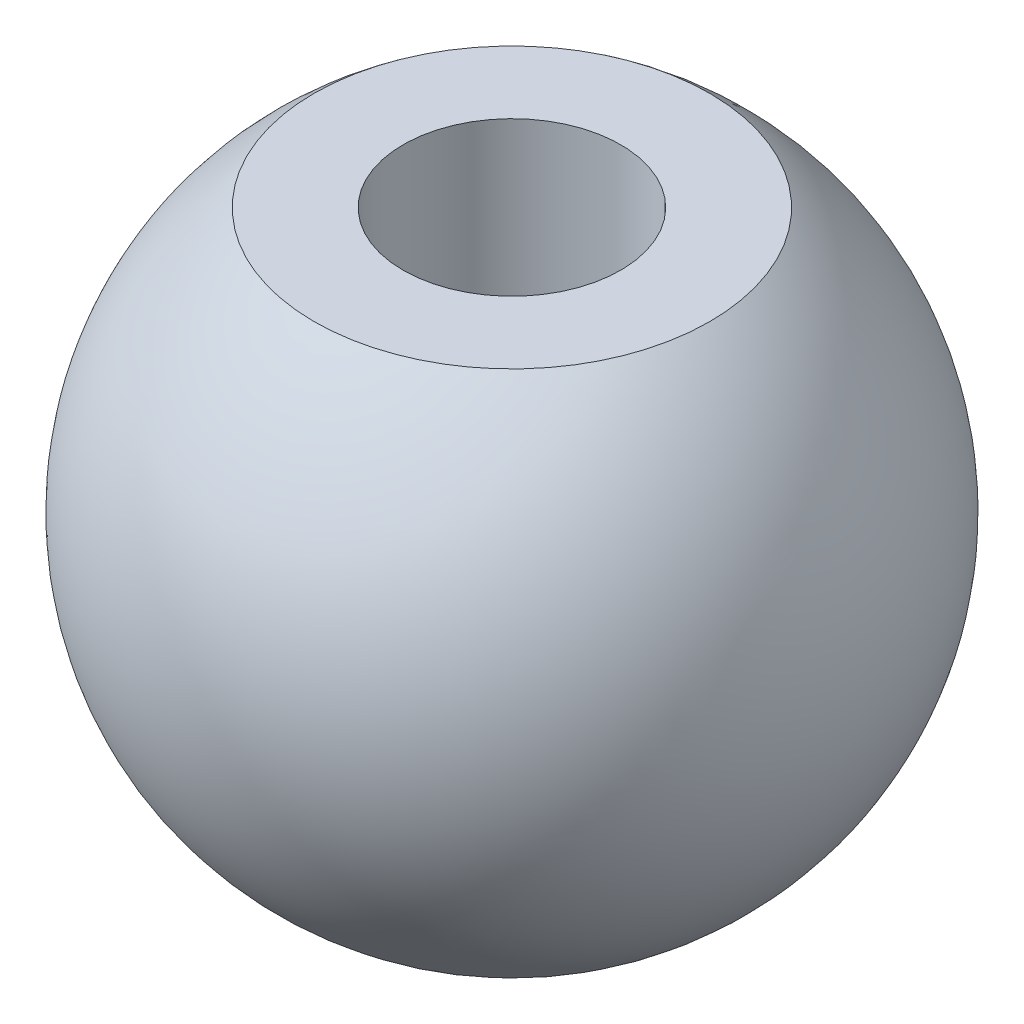
ISO-10303-21;
HEADER;
FILE_DESCRIPTION(('STEP AP214'),'2;1');
FILE_NAME('part.step','',(''),(''),'','','');
FILE_SCHEMA(('AUTOMOTIVE_DESIGN { 1 0 10303 214 1 1 1 1 }'));
ENDSEC;
DATA;
#1=APPLICATION_CONTEXT('core data for automotive mechanical design processes');
#2=APPLICATION_PROTOCOL_DEFINITION('international standard','automotive_design',2000,#1);
#3=PRODUCT_CONTEXT('',#1,'mechanical');
#4=PRODUCT('Part','Part','',(#3));
#5=PRODUCT_RELATED_PRODUCT_CATEGORY('part','',(#4));
#6=PRODUCT_DEFINITION_FORMATION('','',#4);
#7=PRODUCT_DEFINITION_CONTEXT('part definition',#1,'design');
#8=PRODUCT_DEFINITION('design','',#6,#7);
#9=PRODUCT_DEFINITION_SHAPE('','',#8);
#10=(LENGTH_UNIT() NAMED_UNIT(*) SI_UNIT(.MILLI.,.METRE.));
#11=(NAMED_UNIT(*) PLANE_ANGLE_UNIT() SI_UNIT($,.RADIAN.));
#12=(NAMED_UNIT(*) SI_UNIT($,.STERADIAN.) SOLID_ANGLE_UNIT());
#13=UNCERTAINTY_MEASURE_WITH_UNIT(LENGTH_MEASURE(1.E-05),#10,'distance_accuracy_value','');
#14=(GEOMETRIC_REPRESENTATION_CONTEXT(3) GLOBAL_UNCERTAINTY_ASSIGNED_CONTEXT((#13)) GLOBAL_UNIT_ASSIGNED_CONTEXT((#10,
#11,#12)) REPRESENTATION_CONTEXT('',''));
#15=CARTESIAN_POINT('',(0.,0.,0.));
#16=DIRECTION('',(0.,0.,1.));
#17=DIRECTION('',(1.,0.,0.));
#18=AXIS2_PLACEMENT_3D('',#15,#16,#17);
#19=CARTESIAN_POINT('',(0.,3.00000000009959,0.));
#20=DIRECTION('',(0.,1.,0.));
#21=DIRECTION('',(0.,0.,1.));
#22=AXIS2_PLACEMENT_3D('',#19,#20,#21);
#23=CONICAL_SURFACE('',#22,1.65000000009741,1.02974425868617);
#24=CARTESIAN_POINT('',(0.,2.00857997870685,-5.6843418860808E-11));
#25=VERTEX_POINT('',#24);
#26=VERTEX_LOOP('',#25);
#27=FACE_BOUND('',#26,.T.);
#28=CARTESIAN_POINT('',(0.,3.,0.));
#29=DIRECTION('',(0.,1.,0.));
#30=DIRECTION('',(0.,0.,1.));
#31=AXIS2_PLACEMENT_3D('',#28,#29,#30);
#32=CIRCLE('',#31,1.64999999999999);
#33=CARTESIAN_POINT('',(0.,3.,1.64999999999999));
#34=VERTEX_POINT('',#33);
#35=EDGE_CURVE('E38',#34,#34,#32,.T.);
#36=ORIENTED_EDGE('',*,*,#35,.T.);
#37=EDGE_LOOP('',(#36));
#38=FACE_BOUND('',#37,.T.);
#39=ADVANCED_FACE('F17',(#27,#38),#23,.F.);
#40=CARTESIAN_POINT('',(0.,9.,0.));
#41=DIRECTION('',(0.,1.,0.));
#42=DIRECTION('',(0.,0.,1.));
#43=AXIS2_PLACEMENT_3D('',#40,#41,#42);
#44=CYLINDRICAL_SURFACE('',#43,1.64999999999999);
#45=CARTESIAN_POINT('',(0.,9.00000000000001,0.));
#46=DIRECTION('',(0.,1.,0.));
#47=DIRECTION('',(0.,0.,1.));
#48=AXIS2_PLACEMENT_3D('',#45,#46,#47);
#49=CIRCLE('',#48,1.64999999999999);
#50=CARTESIAN_POINT('',(0.,9.00000000000001,1.64999999999999));
#51=VERTEX_POINT('',#50);
#52=EDGE_CURVE('E20',#51,#51,#49,.F.);
#53=ORIENTED_EDGE('',*,*,#52,.F.);
#54=EDGE_LOOP('',(#53));
#55=FACE_BOUND('',#54,.T.);
#56=ORIENTED_EDGE('',*,*,#35,.F.);
#57=EDGE_LOOP('',(#56));
#58=FACE_BOUND('',#57,.T.);
#59=ADVANCED_FACE('F35',(#55,#58),#44,.F.);
#60=CARTESIAN_POINT('',(0.,9.,0.));
#61=DIRECTION('',(0.,1.,0.));
#62=DIRECTION('',(0.,0.,1.));
#63=AXIS2_PLACEMENT_3D('',#60,#61,#62);
#64=PLANE('',#63);
#65=CARTESIAN_POINT('',(3.,9.,0.));
#66=CARTESIAN_POINT('',(2.99999949523358,9.,0.0842305919952533));
#67=CARTESIAN_POINT('',(2.99644943211259,9.,0.168476663637078));
#68=CARTESIAN_POINT('',(2.98227226004286,9.,0.336386615026694));
#69=CARTESIAN_POINT('',(2.9716430617285,9.,0.420050315522544));
#70=CARTESIAN_POINT('',(2.94335544041171,9.,0.586325719817798));
#71=CARTESIAN_POINT('',(2.92568585931676,9.,0.66893553783117));
#72=CARTESIAN_POINT('',(2.8834392718684,9.,0.832418927497677));
#73=CARTESIAN_POINT('',(2.85885666009466,9.,0.91329103260944));
#74=CARTESIAN_POINT('',(2.77507914675548,9.,1.1520882102574));
#75=CARTESIAN_POINT('',(2.70578575365084,9.,1.30659602058505));
#76=CARTESIAN_POINT('',(2.54220609669482,9.,1.60176804513616));
#77=CARTESIAN_POINT('',(2.44791888275831,9.,1.74243173282696));
#78=CARTESIAN_POINT('',(2.28988925157133,9.,1.93998804289462));
#79=CARTESIAN_POINT('',(2.23440451674684,9.,2.00363749091774));
#80=CARTESIAN_POINT('',(2.11831409197694,9.,2.12599212143855));
#81=CARTESIAN_POINT('',(2.05771339098142,9.,2.18470201178521));
#82=CARTESIAN_POINT('',(1.93175254704283,9.,2.29683361010447));
#83=CARTESIAN_POINT('',(1.86639026054782,9.,2.35025291052745));
#84=CARTESIAN_POINT('',(1.73140383285055,9.,2.45140072822542));
#85=CARTESIAN_POINT('',(1.66177870806081,9.,2.49912792458504));
#86=CARTESIAN_POINT('',(1.44726826384113,9.,2.6332068246707));
#87=CARTESIAN_POINT('',(1.29661475821824,9.00000000000001,2.71057412201499));
#88=CARTESIAN_POINT('',(0.984538397939546,9.,2.8388709202637));
#89=CARTESIAN_POINT('',(0.823115658324975,8.99999999999999,2.88980070353314));
#90=CARTESIAN_POINT('',(0.493990143388738,9.00000000000001,2.96385049097127));
#91=CARTESIAN_POINT('',(0.326287334533769,9.00000000000003,2.98697034662314));
#92=CARTESIAN_POINT('',(-0.0106192602137408,8.99999999999998,3.00472003813933));
#93=CARTESIAN_POINT('',(-0.179823046106281,8.99999999999991,2.99934987400365));
#94=CARTESIAN_POINT('',(-0.514907479574972,8.99999999999992,2.96029352946608));
#95=CARTESIAN_POINT('',(-0.680788144893092,9.00000000000001,2.92660750028241));
#96=CARTESIAN_POINT('',(-1.00461791748894,9.,2.83181297793956));
#97=CARTESIAN_POINT('',(-1.16256694003236,8.9999999999999,2.77070419189034));
#98=CARTESIAN_POINT('',(-1.3899784781565,8.99999999999994,2.6599076465673));
#99=CARTESIAN_POINT('',(-1.46423319363285,8.99999999999999,2.61976066033093));
#100=CARTESIAN_POINT('',(-1.60910065464233,9.00000000000002,2.53335675169132));
#101=CARTESIAN_POINT('',(-1.67971423952011,9.00000000000001,2.48710124624338));
#102=CARTESIAN_POINT('',(-1.81676022389609,9.,2.38882598122836));
#103=CARTESIAN_POINT('',(-1.88319450210173,9.,2.33680884112087));
#104=CARTESIAN_POINT('',(-2.01149891422989,9.00000000000001,2.22732998397673));
#105=CARTESIAN_POINT('',(-2.07336458150737,9.,2.16986306092959));
#106=CARTESIAN_POINT('',(-2.25127799272122,9.,1.99000567828742));
#107=CARTESIAN_POINT('',(-2.35982375472715,9.,1.86002810600191));
#108=CARTESIAN_POINT('',(-2.55351363027214,9.,1.5836785802943));
#109=CARTESIAN_POINT('',(-2.63865863331027,9.,1.43730725032208));
#110=CARTESIAN_POINT('',(-2.74706444471415,9.,1.20863511855305));
#111=CARTESIAN_POINT('',(-2.78000876476443,9.,1.13079378015724));
#112=CARTESIAN_POINT('',(-2.83919981739167,9.,0.972654562577402));
#113=CARTESIAN_POINT('',(-2.86545197025815,9.,0.892358730816668));
#114=CARTESIAN_POINT('',(-2.91105470872044,9.,0.729976189150229));
#115=CARTESIAN_POINT('',(-2.93041619248592,9.,0.647892527049513));
#116=CARTESIAN_POINT('',(-2.96215834908893,9.,0.482401803811781));
#117=CARTESIAN_POINT('',(-2.97454108089031,9.00000000000001,0.398995140478582));
#118=CARTESIAN_POINT('',(-2.9889238078401,9.00000000000001,0.262882669784132));
#119=CARTESIAN_POINT('',(-2.99307606547818,9.,0.210394788116347));
#120=CARTESIAN_POINT('',(-2.99861431928428,9.,0.10527328620364));
#121=CARTESIAN_POINT('',(-3.00000031545231,9.,0.0526396659587191));
#122=CARTESIAN_POINT('',(-2.99999949523358,9.,-0.0842305919952533));
#123=CARTESIAN_POINT('',(-2.99644943211259,9.,-0.168476663637078));
#124=CARTESIAN_POINT('',(-2.98227226004286,9.,-0.336386615026693));
#125=CARTESIAN_POINT('',(-2.9716430617285,9.,-0.420050315522543));
#126=CARTESIAN_POINT('',(-2.94335544041171,9.,-0.586325719817797));
#127=CARTESIAN_POINT('',(-2.92568585931676,9.,-0.66893553783117));
#128=CARTESIAN_POINT('',(-2.8834392718684,9.,-0.832418927497676));
#129=CARTESIAN_POINT('',(-2.85885666009466,9.00000000000001,-0.913291032609438));
#130=CARTESIAN_POINT('',(-2.77507914675547,9.00000000000001,-1.1520882102574));
#131=CARTESIAN_POINT('',(-2.70578575365084,9.00000000000001,-1.30659602058505));
#132=CARTESIAN_POINT('',(-2.54220609669482,9.,-1.60176804513616));
#133=CARTESIAN_POINT('',(-2.44791888275831,9.,-1.74243173282696));
#134=CARTESIAN_POINT('',(-2.28988925157133,9.,-1.93998804289462));
#135=CARTESIAN_POINT('',(-2.23440451674683,9.,-2.00363749091774));
#136=CARTESIAN_POINT('',(-2.11831409197693,9.,-2.12599212143855));
#137=CARTESIAN_POINT('',(-2.05771339098142,9.,-2.18470201178521));
#138=CARTESIAN_POINT('',(-1.93175254704283,9.,-2.29683361010447));
#139=CARTESIAN_POINT('',(-1.86639026054782,9.,-2.35025291052745));
#140=CARTESIAN_POINT('',(-1.73140383285055,9.,-2.45140072822542));
#141=CARTESIAN_POINT('',(-1.66177870806081,9.,-2.49912792458504));
#142=CARTESIAN_POINT('',(-1.44726826384113,9.,-2.6332068246707));
#143=CARTESIAN_POINT('',(-1.29661475821824,9.00000000000001,-2.71057412201499));
#144=CARTESIAN_POINT('',(-0.984538397939544,9.,-2.8388709202637));
#145=CARTESIAN_POINT('',(-0.823115658324973,9.,-2.88980070353314));
#146=CARTESIAN_POINT('',(-0.493990143388736,9.00000000000001,-2.96385049097127));
#147=CARTESIAN_POINT('',(-0.326287334533767,9.00000000000003,-2.98697034662314));
#148=CARTESIAN_POINT('',(0.010619260213742,8.99999999999998,-3.00472003813933));
#149=CARTESIAN_POINT('',(0.179823046106282,8.99999999999991,-2.99934987400365));
#150=CARTESIAN_POINT('',(0.514907479574974,8.99999999999992,-2.96029352946608));
#151=CARTESIAN_POINT('',(0.680788144893095,9.00000000000001,-2.92660750028241));
#152=CARTESIAN_POINT('',(1.00461791748895,9.,-2.83181297793956));
#153=CARTESIAN_POINT('',(1.16256694003236,8.9999999999999,-2.77070419189034));
#154=CARTESIAN_POINT('',(1.3899784781565,8.99999999999994,-2.6599076465673));
#155=CARTESIAN_POINT('',(1.46423319363285,8.99999999999999,-2.61976066033093));
#156=CARTESIAN_POINT('',(1.60910065464233,9.00000000000002,-2.53335675169133));
#157=CARTESIAN_POINT('',(1.67971423952011,9.00000000000001,-2.48710124624338));
#158=CARTESIAN_POINT('',(1.8167602238961,9.,-2.38882598122836));
#159=CARTESIAN_POINT('',(1.88319450210173,9.,-2.33680884112087));
#160=CARTESIAN_POINT('',(2.01149891422989,9.00000000000001,-2.22732998397673));
#161=CARTESIAN_POINT('',(2.07336458150737,9.,-2.16986306092959));
#162=CARTESIAN_POINT('',(2.25127799272122,9.,-1.99000567828741));
#163=CARTESIAN_POINT('',(2.35982375472715,9.,-1.86002810600191));
#164=CARTESIAN_POINT('',(2.55351363027214,9.,-1.5836785802943));
#165=CARTESIAN_POINT('',(2.63865863331027,9.,-1.43730725032208));
#166=CARTESIAN_POINT('',(2.74706444471416,9.,-1.20863511855305));
#167=CARTESIAN_POINT('',(2.78000876476443,9.,-1.13079378015723));
#168=CARTESIAN_POINT('',(2.83919981739167,9.,-0.972654562577401));
#169=CARTESIAN_POINT('',(2.86545197025815,9.,-0.892358730816667));
#170=CARTESIAN_POINT('',(2.91105470872044,9.,-0.729976189150228));
#171=CARTESIAN_POINT('',(2.93041619248592,9.,-0.647892527049513));
#172=CARTESIAN_POINT('',(2.96215834908893,9.,-0.482401803811781));
#173=CARTESIAN_POINT('',(2.97454108089031,9.,-0.398995140478581));
#174=CARTESIAN_POINT('',(2.98892380784011,9.,-0.262882669784132));
#175=CARTESIAN_POINT('',(2.99307606547818,9.,-0.210394788116347));
#176=CARTESIAN_POINT('',(2.99861431928429,9.,-0.105273286203641));
#177=CARTESIAN_POINT('',(3.00000031545231,9.,-0.0526396659587192));
#178=CARTESIAN_POINT('',(3.,9.,0.));
#179=B_SPLINE_CURVE_WITH_KNOTS('',3,(#65,#66,#67,#68,#69,#70,#71,#72,#73,#74,#75,#76,#77,#78,
#79,#80,#81,#82,#83,#84,#85,#86,#87,#88,#89,#90,#91,#92,#93,#94,#95,#96,#97,#98,#99,#100,#101,
#102,#103,#104,#105,#106,#107,#108,#109,#110,#111,#112,#113,#114,#115,#116,#117,#118,#119,#120,
#121,#122,#123,#124,#125,#126,#127,#128,#129,#130,#131,#132,#133,#134,#135,#136,#137,#138,#139,
#140,#141,#142,#143,#144,#145,#146,#147,#148,#149,#150,#151,#152,#153,#154,#155,#156,#157,#158,
#159,#160,#161,#162,#163,#164,#165,#166,#167,#168,#169,#170,#171,#172,#173,#174,#175,#176,#177,
#178),.UNSPECIFIED.,.T.,.F.,(4,2,2,2,2,2,2,2,2,2,2,2,2,2,2,2,2,2,2,2,2,2,2,2,2,2,2,2,2,2,2,2,2,
2,2,2,2,2,2,2,2,2,2,2,2,2,2,2,2,2,2,2,2,2,2,2,4),(0.,0.252643316184087,0.505361231639164,
0.758481275542311,1.01180715618274,1.51725134291916,2.02271474576027,2.27577762012547,
2.5285965037646,2.78152991223793,3.03452190295018,3.53997839705089,4.04542949252892,
4.55088328731832,5.05633708210771,5.56178817758575,6.0672446716865,6.32023666239874,
6.57317007087209,6.82598895451123,7.07905182887643,7.58451523171754,8.08995941845397,
8.34328529909439,8.59640534299754,8.84912325845262,9.1017665746367,9.25965528769933,
9.41754400076195,9.67018731694604,9.92290523240111,10.1760252763043,10.4293511569447,
10.9347953436811,11.4402587465222,11.6933216208874,11.9461405045265,12.1990739129999,
12.4520659037121,12.9575223978128,13.4629734932909,13.9684272880803,14.4738810828697,
14.9793321783477,15.4847886724484,15.7377806631607,15.990714071634,16.2435329552732,
16.4965958296384,17.0020592324795,17.5075034192159,17.7608292998563,18.0139493437595,
18.2666672592146,18.5193105753986,18.6771992884613,18.8350880015239),.UNSPECIFIED.);
#180=CARTESIAN_POINT('',(3.,9.,0.));
#181=VERTEX_POINT('',#180);
#182=EDGE_CURVE('E11',#181,#181,#179,.T.);
#183=ORIENTED_EDGE('',*,*,#182,.F.);
#184=EDGE_LOOP('',(#183));
#185=FACE_BOUND('',#184,.T.);
#186=ORIENTED_EDGE('',*,*,#52,.T.);
#187=EDGE_LOOP('',(#186));
#188=FACE_BOUND('',#187,.T.);
#189=ADVANCED_FACE('F50',(#185,#188),#64,.T.);
#190=CARTESIAN_POINT('',(0.,5.,0.));
#191=DIRECTION('',(-1.,0.,0.));
#192=DIRECTION('',(0.,1.,0.));
#193=AXIS2_PLACEMENT_3D('',#190,#191,#192);
#194=SPHERICAL_SURFACE('',#193,5.);
#195=CARTESIAN_POINT('',(5.,5.,0.));
#196=VERTEX_POINT('',#195);
#197=VERTEX_LOOP('',#196);
#198=FACE_BOUND('',#197,.T.);
#199=ORIENTED_EDGE('',*,*,#182,.T.);
#200=EDGE_LOOP('',(#199));
#201=FACE_BOUND('',#200,.T.);
#202=CARTESIAN_POINT('',(-5.,5.,0.));
#203=VERTEX_POINT('',#202);
#204=VERTEX_LOOP('',#203);
#205=FACE_BOUND('',#204,.T.);
#206=ADVANCED_FACE('F48',(#198,#201,#205),#194,.T.);
#207=CLOSED_SHELL('',(#39,#59,#189,#206));
#208=MANIFOLD_SOLID_BREP('B1',#207);
#209=ADVANCED_BREP_SHAPE_REPRESENTATION('',(#18,#208),#14);
#210=SHAPE_DEFINITION_REPRESENTATION(#9,#209);
ENDSEC;
END-ISO-10303-21;
